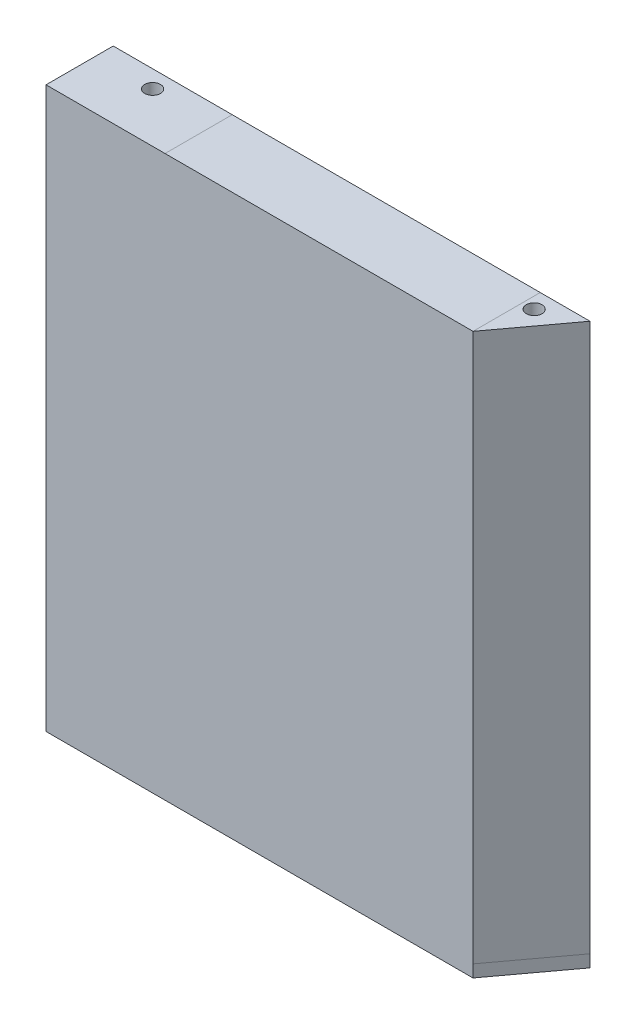
ISO-10303-21;
HEADER;
FILE_DESCRIPTION(('STEP AP214'),'2;1');
FILE_NAME('part.step','',(''),(''),'','','');
FILE_SCHEMA(('AUTOMOTIVE_DESIGN { 1 0 10303 214 1 1 1 1 }'));
ENDSEC;
DATA;
#1=APPLICATION_CONTEXT('core data for automotive mechanical design processes');
#2=APPLICATION_PROTOCOL_DEFINITION('international standard','automotive_design',2000,#1);
#3=PRODUCT_CONTEXT('',#1,'mechanical');
#4=PRODUCT('Part','Part','',(#3));
#5=PRODUCT_RELATED_PRODUCT_CATEGORY('part','',(#4));
#6=PRODUCT_DEFINITION_FORMATION('','',#4);
#7=PRODUCT_DEFINITION_CONTEXT('part definition',#1,'design');
#8=PRODUCT_DEFINITION('design','',#6,#7);
#9=PRODUCT_DEFINITION_SHAPE('','',#8);
#10=(LENGTH_UNIT() NAMED_UNIT(*) SI_UNIT(.MILLI.,.METRE.));
#11=(NAMED_UNIT(*) PLANE_ANGLE_UNIT() SI_UNIT($,.RADIAN.));
#12=(NAMED_UNIT(*) SI_UNIT($,.STERADIAN.) SOLID_ANGLE_UNIT());
#13=UNCERTAINTY_MEASURE_WITH_UNIT(LENGTH_MEASURE(1.E-05),#10,'distance_accuracy_value','');
#14=(GEOMETRIC_REPRESENTATION_CONTEXT(3) GLOBAL_UNCERTAINTY_ASSIGNED_CONTEXT((#13)) GLOBAL_UNIT_ASSIGNED_CONTEXT((#10,
#11,#12)) REPRESENTATION_CONTEXT('',''));
#15=CARTESIAN_POINT('',(0.,0.,0.));
#16=DIRECTION('',(0.,0.,1.));
#17=DIRECTION('',(1.,0.,0.));
#18=AXIS2_PLACEMENT_3D('',#15,#16,#17);
#19=CARTESIAN_POINT('',(50.3065542401003,154.635951867559,125.000000000008));
#20=DIRECTION('',(0.,0.,-1.));
#21=DIRECTION('',(-1.,0.,0.));
#22=AXIS2_PLACEMENT_3D('',#19,#20,#21);
#23=PLANE('',#22);
#24=DIRECTION('',(-0.999999999275046,-3.80776607437729E-05,0.));
#25=VECTOR('',#24,1.);
#26=CARTESIAN_POINT('',(50.3062876964751,161.635951862484,125.000000000008));
#27=LINE('',#26,#25);
#28=CARTESIAN_POINT('',(78.7062876758864,161.637033268049,125.000000000008));
#29=VERTEX_POINT('',#28);
#30=CARTESIAN_POINT('',(50.3062876964751,161.635951862484,125.000000000008));
#31=VERTEX_POINT('',#30);
#32=EDGE_CURVE('E104',#29,#31,#27,.T.);
#33=ORIENTED_EDGE('',*,*,#32,.F.);
#34=DIRECTION('',(-3.80776607443227E-05,0.999999999275046,0.));
#35=VECTOR('',#34,1.);
#36=CARTESIAN_POINT('',(78.7065542195116,154.637033273124,125.000000000008));
#37=LINE('',#36,#35);
#38=CARTESIAN_POINT('',(78.7182059836992,-151.36296650504,125.000000000008));
#39=VERTEX_POINT('',#38);
#40=EDGE_CURVE('E12',#39,#29,#37,.T.);
#41=ORIENTED_EDGE('',*,*,#40,.F.);
#42=DIRECTION('',(0.999999999275046,3.80776607459916E-05,0.));
#43=VECTOR('',#42,1.);
#44=CARTESIAN_POINT('',(73.5411158169178,-151.363163636523,125.000000000008));
#45=LINE('',#44,#43);
#46=CARTESIAN_POINT('',(73.5411158169178,-151.363163636523,125.000000000008));
#47=VERTEX_POINT('',#46);
#48=EDGE_CURVE('E125',#47,#39,#45,.T.);
#49=ORIENTED_EDGE('',*,*,#48,.F.);
#50=DIRECTION('',(-3.80776607437729E-05,0.999999999275046,0.));
#51=VECTOR('',#50,1.);
#52=CARTESIAN_POINT('',(73.5411158169178,-151.363163636523,125.000000000008));
#53=LINE('',#52,#51);
#54=CARTESIAN_POINT('',(73.5294640527302,154.636836141641,125.000000000008));
#55=VERTEX_POINT('',#54);
#56=EDGE_CURVE('E116',#47,#55,#53,.T.);
#57=ORIENTED_EDGE('',*,*,#56,.T.);
#58=DIRECTION('',(-0.999999999275046,-3.80776607437729E-05,0.));
#59=VECTOR('',#58,1.);
#60=CARTESIAN_POINT('',(50.3065542401003,154.635951867559,125.000000000008));
#61=LINE('',#60,#59);
#62=CARTESIAN_POINT('',(50.3065542401003,154.635951867559,125.000000000008));
#63=VERTEX_POINT('',#62);
#64=EDGE_CURVE('E71',#55,#63,#61,.T.);
#65=ORIENTED_EDGE('',*,*,#64,.T.);
#66=DIRECTION('',(-3.80776607443227E-05,0.999999999275046,0.));
#67=VECTOR('',#66,1.);
#68=CARTESIAN_POINT('',(50.3065542401003,154.635951867559,125.000000000008));
#69=LINE('',#68,#67);
#70=EDGE_CURVE('E97',#63,#31,#69,.T.);
#71=ORIENTED_EDGE('',*,*,#70,.T.);
#72=EDGE_LOOP('',(#33,#41,#49,#57,#65,#71));
#73=FACE_BOUND('',#72,.T.);
#74=ADVANCED_FACE('F47',(#73),#23,.T.);
#75=CARTESIAN_POINT('',(78.7065542195116,154.637033273124,125.000000000008));
#76=DIRECTION('',(0.804002053393767,3.06145174490608E-05,0.594626519086862));
#77=DIRECTION('',(0.594626519365518,0.,-0.804002053770542));
#78=AXIS2_PLACEMENT_3D('',#75,#76,#77);
#79=PLANE('',#78);
#80=DIRECTION('',(0.594626518655785,2.26419868630401E-05,-0.804002053976631));
#81=VECTOR('',#80,1.);
#82=CARTESIAN_POINT('',(78.7062876758864,161.637033268049,125.000000000008));
#83=LINE('',#82,#81);
#84=CARTESIAN_POINT('',(50.3062876964751,161.635951862484,163.400000000009));
#85=VERTEX_POINT('',#84);
#86=EDGE_CURVE('E102',#85,#29,#83,.T.);
#87=ORIENTED_EDGE('',*,*,#86,.F.);
#88=DIRECTION('',(-3.80776607443227E-05,0.999999999275046,0.));
#89=VECTOR('',#88,1.);
#90=CARTESIAN_POINT('',(50.3065542401003,154.635951867559,163.400000000009));
#91=LINE('',#90,#89);
#92=CARTESIAN_POINT('',(50.3182060042879,-151.364047910605,163.400000000009));
#93=VERTEX_POINT('',#92);
#94=EDGE_CURVE('E55',#93,#85,#91,.T.);
#95=ORIENTED_EDGE('',*,*,#94,.F.);
#96=DIRECTION('',(-0.594626518655785,-2.26419868630401E-05,0.804002053976631));
#97=VECTOR('',#96,1.);
#98=CARTESIAN_POINT('',(50.3182060042879,-151.364047910605,163.400000000009));
#99=LINE('',#98,#97);
#100=EDGE_CURVE('E119',#39,#93,#99,.T.);
#101=ORIENTED_EDGE('',*,*,#100,.F.);
#102=ORIENTED_EDGE('',*,*,#40,.T.);
#103=EDGE_LOOP('',(#87,#95,#101,#102));
#104=FACE_BOUND('',#103,.T.);
#105=ADVANCED_FACE('F106',(#104),#79,.T.);
#106=CARTESIAN_POINT('',(50.3065542401003,154.635951867559,125.000000000008));
#107=DIRECTION('',(-0.999999999275046,-3.80776607443227E-05,0.));
#108=DIRECTION('',(3.80776607443227E-05,-0.999999999275046,0.));
#109=AXIS2_PLACEMENT_3D('',#106,#107,#108);
#110=PLANE('',#109);
#111=DIRECTION('',(0.,0.,1.));
#112=VECTOR('',#111,1.);
#113=CARTESIAN_POINT('',(50.3062876964751,161.635951862484,125.000000000008));
#114=LINE('',#113,#112);
#115=EDGE_CURVE('E88',#31,#85,#114,.T.);
#116=ORIENTED_EDGE('',*,*,#115,.F.);
#117=ORIENTED_EDGE('',*,*,#70,.F.);
#118=DIRECTION('',(0.,0.,1.));
#119=VECTOR('',#118,1.);
#120=CARTESIAN_POINT('',(50.3065542401003,154.635951867559,125.000000000008));
#121=LINE('',#120,#119);
#122=CARTESIAN_POINT('',(50.3065542401003,154.635951867559,156.399990755343));
#123=VERTEX_POINT('',#122);
#124=EDGE_CURVE('E109',#63,#123,#121,.T.);
#125=ORIENTED_EDGE('',*,*,#124,.T.);
#126=DIRECTION('',(-3.80776607437729E-05,0.999999999275046,0.));
#127=VECTOR('',#126,1.);
#128=CARTESIAN_POINT('',(50.3182060042879,-151.364047910605,156.399990755343));
#129=LINE('',#128,#127);
#130=CARTESIAN_POINT('',(50.3182060042879,-151.364047910605,156.399990755343));
#131=VERTEX_POINT('',#130);
#132=EDGE_CURVE('E115',#131,#123,#129,.T.);
#133=ORIENTED_EDGE('',*,*,#132,.F.);
#134=DIRECTION('',(0.,0.,-1.));
#135=VECTOR('',#134,1.);
#136=CARTESIAN_POINT('',(50.3182060042879,-151.364047910605,156.399990755343));
#137=LINE('',#136,#135);
#138=EDGE_CURVE('E92',#93,#131,#137,.T.);
#139=ORIENTED_EDGE('',*,*,#138,.F.);
#140=ORIENTED_EDGE('',*,*,#94,.T.);
#141=EDGE_LOOP('',(#116,#117,#125,#133,#139,#140));
#142=FACE_BOUND('',#141,.T.);
#143=ADVANCED_FACE('F87',(#142),#110,.T.);
#144=CARTESIAN_POINT('',(-0.00588810236984288,154.634036087447,0.));
#145=DIRECTION('',(3.80776607437729E-05,-0.999999999275046,0.));
#146=DIRECTION('',(0.999999999275046,3.80776607437729E-05,0.));
#147=AXIS2_PLACEMENT_3D('',#144,#145,#146);
#148=PLANE('',#147);
#149=CARTESIAN_POINT('',(56.8175434212163,154.636199790796,135.000000000008));
#150=DIRECTION('',(3.80776607437729E-05,-0.999999999275046,0.));
#151=DIRECTION('',(0.999999999275046,3.80776607437729E-05,0.));
#152=AXIS2_PLACEMENT_3D('',#149,#150,#151);
#153=CIRCLE('',#152,4.50000000000001);
#154=CARTESIAN_POINT('',(61.317543417954,154.636371140269,135.000000000008));
#155=VERTEX_POINT('',#154);
#156=EDGE_CURVE('E123',#155,#155,#153,.T.);
#157=ORIENTED_EDGE('',*,*,#156,.F.);
#158=EDGE_LOOP('',(#157));
#159=FACE_BOUND('',#158,.T.);
#160=DIRECTION('',(0.594626518655785,2.2641986862746E-05,-0.804002053976631));
#161=VECTOR('',#160,1.);
#162=CARTESIAN_POINT('',(50.3065542401003,154.635951867559,156.399990755343));
#163=LINE('',#162,#161);
#164=EDGE_CURVE('E63',#123,#55,#163,.T.);
#165=ORIENTED_EDGE('',*,*,#164,.F.);
#166=ORIENTED_EDGE('',*,*,#124,.F.);
#167=ORIENTED_EDGE('',*,*,#64,.F.);
#168=EDGE_LOOP('',(#165,#166,#167));
#169=FACE_BOUND('',#168,.T.);
#170=ADVANCED_FACE('F162',(#159,#169),#148,.T.);
#171=CARTESIAN_POINT('',(-0.00615464599505314,161.634036082372,0.));
#172=DIRECTION('',(3.80776607437729E-05,-0.999999999275046,0.));
#173=DIRECTION('',(0.999999999275046,3.80776607437729E-05,0.));
#174=AXIS2_PLACEMENT_3D('',#171,#172,#173);
#175=PLANE('',#174);
#176=CARTESIAN_POINT('',(56.8172768775909,161.636199785721,135.000000000008));
#177=DIRECTION('',(3.80776607437729E-05,-0.999999999275046,0.));
#178=DIRECTION('',(0.999999999275046,3.80776607437729E-05,0.));
#179=AXIS2_PLACEMENT_3D('',#176,#177,#178);
#180=CIRCLE('',#179,4.50000000000001);
#181=CARTESIAN_POINT('',(61.3172768743286,161.636371135195,135.000000000008));
#182=VERTEX_POINT('',#181);
#183=EDGE_CURVE('E50',#182,#182,#180,.T.);
#184=ORIENTED_EDGE('',*,*,#183,.T.);
#185=EDGE_LOOP('',(#184));
#186=FACE_BOUND('',#185,.T.);
#187=ORIENTED_EDGE('',*,*,#32,.T.);
#188=ORIENTED_EDGE('',*,*,#115,.T.);
#189=ORIENTED_EDGE('',*,*,#86,.T.);
#190=EDGE_LOOP('',(#187,#188,#189));
#191=FACE_BOUND('',#190,.T.);
#192=ADVANCED_FACE('F101',(#186,#191),#175,.F.);
#193=CARTESIAN_POINT('',(50.3182060042879,-151.364047910605,156.399990755343));
#194=DIRECTION('',(0.804002053393766,3.06145174486187E-05,0.594626519086862));
#195=DIRECTION('',(0.594626519365519,0.,-0.804002053770541));
#196=AXIS2_PLACEMENT_3D('',#193,#194,#195);
#197=PLANE('',#196);
#198=ORIENTED_EDGE('',*,*,#164,.T.);
#199=ORIENTED_EDGE('',*,*,#56,.F.);
#200=DIRECTION('',(0.594626518655785,2.2641986862746E-05,-0.804002053976631));
#201=VECTOR('',#200,1.);
#202=CARTESIAN_POINT('',(50.3182060042879,-151.364047910605,156.399990755343));
#203=LINE('',#202,#201);
#204=EDGE_CURVE('E128',#131,#47,#203,.T.);
#205=ORIENTED_EDGE('',*,*,#204,.F.);
#206=ORIENTED_EDGE('',*,*,#132,.T.);
#207=EDGE_LOOP('',(#198,#199,#205,#206));
#208=FACE_BOUND('',#207,.T.);
#209=ADVANCED_FACE('F146',(#208),#197,.F.);
#210=CARTESIAN_POINT('',(0.0057636618174047,-151.365963690718,0.));
#211=DIRECTION('',(-3.80776607459916E-05,0.999999999275046,0.));
#212=DIRECTION('',(-0.999999999275046,-3.80776607459916E-05,0.));
#213=AXIS2_PLACEMENT_3D('',#210,#211,#212);
#214=PLANE('',#213);
#215=ORIENTED_EDGE('',*,*,#138,.T.);
#216=ORIENTED_EDGE('',*,*,#204,.T.);
#217=ORIENTED_EDGE('',*,*,#48,.T.);
#218=ORIENTED_EDGE('',*,*,#100,.T.);
#219=EDGE_LOOP('',(#215,#216,#217,#218));
#220=FACE_BOUND('',#219,.T.);
#221=ADVANCED_FACE('F141',(#220),#214,.F.);
#222=CARTESIAN_POINT('',(56.8172764826691,161.646571268237,135.000000000008));
#223=DIRECTION('',(3.80776607748151E-05,-0.999999999275046,0.));
#224=DIRECTION('',(0.999999999275046,3.80776607748151E-05,0.));
#225=AXIS2_PLACEMENT_3D('',#222,#223,#224);
#226=CYLINDRICAL_SURFACE('',#225,4.50000000000001);
#227=ORIENTED_EDGE('',*,*,#156,.T.);
#228=EDGE_LOOP('',(#227));
#229=FACE_BOUND('',#228,.T.);
#230=ORIENTED_EDGE('',*,*,#183,.F.);
#231=EDGE_LOOP('',(#230));
#232=FACE_BOUND('',#231,.T.);
#233=ADVANCED_FACE('F139',(#229,#232),#226,.F.);
#234=CLOSED_SHELL('',(#74,#105,#143,#170,#192,#209,#221,#233));
#235=MANIFOLD_SOLID_BREP('B2',#234);
#236=CARTESIAN_POINT('',(50.2840677250155,147.63595100625,163.400000000009));
#237=DIRECTION('',(-1.,0.,0.));
#238=DIRECTION('',(0.,-1.,0.));
#239=AXIS2_PLACEMENT_3D('',#236,#237,#238);
#240=PLANE('',#239);
#241=DIRECTION('',(0.,1.,0.));
#242=VECTOR('',#241,1.);
#243=CARTESIAN_POINT('',(50.2840677250155,147.63595100625,163.400000000009));
#244=LINE('',#243,#242);
#245=CARTESIAN_POINT('',(50.2840677250154,-158.364049215907,163.400000000009));
#246=VERTEX_POINT('',#245);
#247=CARTESIAN_POINT('',(50.2840677250155,147.63595100625,163.400000000009));
#248=VERTEX_POINT('',#247);
#249=EDGE_CURVE('E243',#246,#248,#244,.T.);
#250=ORIENTED_EDGE('',*,*,#249,.F.);
#251=DIRECTION('',(0.,0.999999998674633,-5.14852877398055E-05));
#252=VECTOR('',#251,1.);
#253=CARTESIAN_POINT('',(50.2840677250155,147.635950195125,163.38424550197));
#254=LINE('',#253,#252);
#255=CARTESIAN_POINT('',(50.2840677250155,-151.364049210832,163.399639602994));
#256=VERTEX_POINT('',#255);
#257=EDGE_CURVE('E423',#246,#256,#254,.T.);
#258=ORIENTED_EDGE('',*,*,#257,.T.);
#259=DIRECTION('',(0.,0.,1.));
#260=VECTOR('',#259,1.);
#261=CARTESIAN_POINT('',(50.2840677250155,-151.364049210832,163.400000000009));
#262=LINE('',#261,#260);
#263=CARTESIAN_POINT('',(50.2840677250235,-151.364049210832,156.400000000009));
#264=VERTEX_POINT('',#263);
#265=EDGE_CURVE('E334',#264,#256,#262,.T.);
#266=ORIENTED_EDGE('',*,*,#265,.F.);
#267=DIRECTION('',(0.,1.,0.));
#268=VECTOR('',#267,1.);
#269=CARTESIAN_POINT('',(50.2840677250155,147.63595100625,156.400000000009));
#270=LINE('',#269,#268);
#271=CARTESIAN_POINT('',(50.2840677250155,147.63595100625,156.400000000009));
#272=VERTEX_POINT('',#271);
#273=EDGE_CURVE('E293',#264,#272,#270,.T.);
#274=ORIENTED_EDGE('',*,*,#273,.T.);
#275=DIRECTION('',(0.,0.,-1.));
#276=VECTOR('',#275,1.);
#277=CARTESIAN_POINT('',(50.2840677250155,147.63595100625,163.400000000009));
#278=LINE('',#277,#276);
#279=EDGE_CURVE('E45',#248,#272,#278,.T.);
#280=ORIENTED_EDGE('',*,*,#279,.F.);
#281=EDGE_LOOP('',(#250,#258,#266,#274,#280));
#282=FACE_BOUND('',#281,.T.);
#283=ADVANCED_FACE('F227',(#282),#240,.F.);
#284=CARTESIAN_POINT('',(50.2840677250155,147.63595100625,163.400000000009));
#285=DIRECTION('',(-0.999998740494545,0.0015871387224644,0.));
#286=DIRECTION('',(-0.0015871387224644,-0.999998740494545,0.));
#287=AXIS2_PLACEMENT_3D('',#284,#285,#286);
#288=PLANE('',#287);
#289=DIRECTION('',(0.0015871387224644,0.999998740494545,0.));
#290=VECTOR('',#289,1.);
#291=CARTESIAN_POINT('',(50.2840677250155,147.63595100625,156.400000000009));
#292=LINE('',#291,#290);
#293=CARTESIAN_POINT('',(50.2951777107453,154.635951434367,156.400000000009));
#294=VERTEX_POINT('',#293);
#295=EDGE_CURVE('E277',#272,#294,#292,.T.);
#296=ORIENTED_EDGE('',*,*,#295,.T.);
#297=DIRECTION('',(0.,0.,1.));
#298=VECTOR('',#297,1.);
#299=CARTESIAN_POINT('',(50.2951777107453,154.635951434367,125.000000000008));
#300=LINE('',#299,#298);
#301=CARTESIAN_POINT('',(50.2951777107453,154.635951434367,125.000000000008));
#302=VERTEX_POINT('',#301);
#303=EDGE_CURVE('E290',#302,#294,#300,.T.);
#304=ORIENTED_EDGE('',*,*,#303,.F.);
#305=DIRECTION('',(0.00158713872246539,0.999998740494545,0.));
#306=VECTOR('',#305,1.);
#307=CARTESIAN_POINT('',(50.2951777107453,154.635951434367,125.000000000008));
#308=LINE('',#307,#306);
#309=CARTESIAN_POINT('',(50.3062876964751,161.635951862484,125.000000000008));
#310=VERTEX_POINT('',#309);
#311=EDGE_CURVE('E432',#302,#310,#308,.T.);
#312=ORIENTED_EDGE('',*,*,#311,.T.);
#313=DIRECTION('',(0.,0.,1.));
#314=VECTOR('',#313,1.);
#315=CARTESIAN_POINT('',(50.3062876964751,161.635951862484,125.000000000008));
#316=LINE('',#315,#314);
#317=CARTESIAN_POINT('',(50.3062876964751,161.635951862484,163.400000000009));
#318=VERTEX_POINT('',#317);
#319=EDGE_CURVE('E299',#310,#318,#316,.T.);
#320=ORIENTED_EDGE('',*,*,#319,.T.);
#321=DIRECTION('',(0.0015871387224644,0.999998740494545,0.));
#322=VECTOR('',#321,1.);
#323=CARTESIAN_POINT('',(50.2840677250155,147.63595100625,163.400000000009));
#324=LINE('',#323,#322);
#325=EDGE_CURVE('E236',#248,#318,#324,.T.);
#326=ORIENTED_EDGE('',*,*,#325,.F.);
#327=ORIENTED_EDGE('',*,*,#279,.T.);
#328=EDGE_LOOP('',(#296,#304,#312,#320,#326,#327));
#329=FACE_BOUND('',#328,.T.);
#330=ADVANCED_FACE('F287',(#329),#288,.F.);
#331=CARTESIAN_POINT('',(0.,0.,163.400000000009));
#332=DIRECTION('',(0.,0.,1.));
#333=DIRECTION('',(1.,0.,0.));
#334=AXIS2_PLACEMENT_3D('',#331,#332,#333);
#335=PLANE('',#334);
#336=ORIENTED_EDGE('',*,*,#325,.T.);
#337=DIRECTION('',(-0.999999999275046,-3.80776607443227E-05,0.));
#338=VECTOR('',#337,1.);
#339=CARTESIAN_POINT('',(50.3062876964751,161.635951862484,163.400000000009));
#340=LINE('',#339,#338);
#341=CARTESIAN_POINT('',(-125.672841840363,161.629250988886,163.400000000009));
#342=VERTEX_POINT('',#341);
#343=EDGE_CURVE('E426',#318,#342,#340,.T.);
#344=ORIENTED_EDGE('',*,*,#343,.T.);
#345=DIRECTION('',(-1.,0.,0.));
#346=VECTOR('',#345,1.);
#347=CARTESIAN_POINT('',(-125.672841840363,161.629250988886,163.400000000009));
#348=LINE('',#347,#346);
#349=CARTESIAN_POINT('',(-193.670804646049,161.629250988886,163.400000000009));
#350=VERTEX_POINT('',#349);
#351=EDGE_CURVE('E473',#342,#350,#348,.T.);
#352=ORIENTED_EDGE('',*,*,#351,.T.);
#353=DIRECTION('',(0.,-1.,0.));
#354=VECTOR('',#353,1.);
#355=CARTESIAN_POINT('',(-193.670804646049,161.629250988886,163.400000000009));
#356=LINE('',#355,#354);
#357=CARTESIAN_POINT('',(-193.670804646049,104.626907443491,163.400000000009));
#358=VERTEX_POINT('',#357);
#359=EDGE_CURVE('E477',#350,#358,#356,.T.);
#360=ORIENTED_EDGE('',*,*,#359,.T.);
#361=DIRECTION('',(3.80776607549472E-05,-0.999999999275046,0.));
#362=VECTOR('',#361,1.);
#363=CARTESIAN_POINT('',(-193.670804646049,104.626907443491,163.400000000009));
#364=LINE('',#363,#362);
#365=CARTESIAN_POINT('',(-193.670538102423,97.6269074369599,163.400000000009));
#366=VERTEX_POINT('',#365);
#367=EDGE_CURVE('E483',#358,#366,#364,.T.);
#368=ORIENTED_EDGE('',*,*,#367,.T.);
#369=DIRECTION('',(0.,-1.,0.));
#370=VECTOR('',#369,1.);
#371=CARTESIAN_POINT('',(-193.670538102423,97.6269074369599,163.400000000009));
#372=LINE('',#371,#370);
#373=CARTESIAN_POINT('',(-193.670538102423,-158.372995371589,163.400000000009));
#374=VERTEX_POINT('',#373);
#375=EDGE_CURVE('E434',#366,#374,#372,.T.);
#376=ORIENTED_EDGE('',*,*,#375,.T.);
#377=DIRECTION('',(1.,2.74178898694674E-13,0.));
#378=VECTOR('',#377,1.);
#379=CARTESIAN_POINT('',(-193.670538102423,-158.372995371589,163.400000000009));
#380=LINE('',#379,#378);
#381=CARTESIAN_POINT('',(-184.660923425468,-158.372995371587,163.400000000009));
#382=VERTEX_POINT('',#381);
#383=EDGE_CURVE('E430',#374,#382,#380,.T.);
#384=ORIENTED_EDGE('',*,*,#383,.T.);
#385=DIRECTION('',(0.999999999275046,3.80776607748174E-05,0.));
#386=VECTOR('',#385,1.);
#387=CARTESIAN_POINT('',(-184.660923425468,-158.372995371587,163.400000000009));
#388=LINE('',#387,#386);
#389=EDGE_CURVE('E411',#382,#246,#388,.T.);
#390=ORIENTED_EDGE('',*,*,#389,.T.);
#391=ORIENTED_EDGE('',*,*,#249,.T.);
#392=EDGE_LOOP('',(#336,#344,#352,#360,#368,#376,#384,#390,#391));
#393=FACE_BOUND('',#392,.T.);
#394=ADVANCED_FACE('F428',(#393),#335,.T.);
#395=CARTESIAN_POINT('',(0.,0.,156.400000000009));
#396=DIRECTION('',(0.,0.,1.));
#397=DIRECTION('',(1.,0.,0.));
#398=AXIS2_PLACEMENT_3D('',#395,#396,#397);
#399=PLANE('',#398);
#400=DIRECTION('',(-1.,0.,0.));
#401=VECTOR('',#400,1.);
#402=CARTESIAN_POINT('',(-125.672708569028,154.629250988886,156.400000000009));
#403=LINE('',#402,#401);
#404=CARTESIAN_POINT('',(-125.672708569028,154.629250988886,156.400000000009));
#405=VERTEX_POINT('',#404);
#406=CARTESIAN_POINT('',(-186.670804646049,154.629250988889,156.400000000009));
#407=VERTEX_POINT('',#406);
#408=EDGE_CURVE('E279',#405,#407,#403,.T.);
#409=ORIENTED_EDGE('',*,*,#408,.F.);
#410=DIRECTION('',(-0.999999999275046,-3.80776607554781E-05,0.));
#411=VECTOR('',#410,1.);
#412=CARTESIAN_POINT('',(-125.672708569028,154.629250988886,156.400000000009));
#413=LINE('',#412,#411);
#414=EDGE_CURVE('E273',#294,#405,#413,.T.);
#415=ORIENTED_EDGE('',*,*,#414,.F.);
#416=ORIENTED_EDGE('',*,*,#295,.F.);
#417=ORIENTED_EDGE('',*,*,#273,.F.);
#418=DIRECTION('',(0.999999999275046,3.80776607746463E-05,0.));
#419=VECTOR('',#418,1.);
#420=CARTESIAN_POINT('',(50.2840677250155,-151.364049210832,156.400000000009));
#421=LINE('',#420,#419);
#422=CARTESIAN_POINT('',(-184.661056762062,-151.372995371589,156.400000000009));
#423=VERTEX_POINT('',#422);
#424=EDGE_CURVE('E326',#423,#264,#421,.T.);
#425=ORIENTED_EDGE('',*,*,#424,.F.);
#426=DIRECTION('',(1.,-1.22929543070416E-12,0.));
#427=VECTOR('',#426,1.);
#428=CARTESIAN_POINT('',(-184.661056762062,-151.372995371589,156.400000000009));
#429=LINE('',#428,#427);
#430=CARTESIAN_POINT('',(-186.670538102423,-151.372995371587,156.400000000009));
#431=VERTEX_POINT('',#430);
#432=EDGE_CURVE('E323',#431,#423,#429,.T.);
#433=ORIENTED_EDGE('',*,*,#432,.F.);
#434=DIRECTION('',(0.,-1.,0.));
#435=VECTOR('',#434,1.);
#436=CARTESIAN_POINT('',(-186.670538102423,97.6270407081138,156.400000000009));
#437=LINE('',#436,#435);
#438=CARTESIAN_POINT('',(-186.670538102423,97.6270407081138,156.400000000009));
#439=VERTEX_POINT('',#438);
#440=EDGE_CURVE('E320',#439,#431,#437,.T.);
#441=ORIENTED_EDGE('',*,*,#440,.F.);
#442=DIRECTION('',(3.807766075395E-05,-0.999999999275046,0.));
#443=VECTOR('',#442,1.);
#444=CARTESIAN_POINT('',(-186.670804646049,104.627040714099,156.400000000009));
#445=LINE('',#444,#443);
#446=CARTESIAN_POINT('',(-186.670804646049,104.627040714099,156.400000000009));
#447=VERTEX_POINT('',#446);
#448=EDGE_CURVE('E317',#447,#439,#445,.T.);
#449=ORIENTED_EDGE('',*,*,#448,.F.);
#450=DIRECTION('',(0.,-1.,0.));
#451=VECTOR('',#450,1.);
#452=CARTESIAN_POINT('',(-186.670804646049,154.629250988889,156.400000000009));
#453=LINE('',#452,#451);
#454=EDGE_CURVE('E313',#407,#447,#453,.T.);
#455=ORIENTED_EDGE('',*,*,#454,.F.);
#456=EDGE_LOOP('',(#409,#415,#416,#417,#425,#433,#441,#449,#455));
#457=FACE_BOUND('',#456,.T.);
#458=ADVANCED_FACE('F275',(#457),#399,.F.);
#459=CARTESIAN_POINT('',(50.2951777107453,154.635951434367,125.000000000008));
#460=DIRECTION('',(3.80776607443095E-05,-0.999999999275046,0.));
#461=DIRECTION('',(0.999999999275046,3.80776607443095E-05,0.));
#462=AXIS2_PLACEMENT_3D('',#459,#460,#461);
#463=PLANE('',#462);
#464=ORIENTED_EDGE('',*,*,#414,.T.);
#465=DIRECTION('',(0.,0.,1.));
#466=VECTOR('',#465,1.);
#467=CARTESIAN_POINT('',(-125.672708569028,154.629250988886,125.000000000008));
#468=LINE('',#467,#466);
#469=CARTESIAN_POINT('',(-125.672708569028,154.629250988886,125.000000000008));
#470=VERTEX_POINT('',#469);
#471=EDGE_CURVE('E314',#470,#405,#468,.T.);
#472=ORIENTED_EDGE('',*,*,#471,.F.);
#473=DIRECTION('',(0.999999999275046,3.80776607443095E-05,0.));
#474=VECTOR('',#473,1.);
#475=CARTESIAN_POINT('',(50.2951777107453,154.635951434367,125.000000000008));
#476=LINE('',#475,#474);
#477=EDGE_CURVE('E298',#470,#302,#476,.T.);
#478=ORIENTED_EDGE('',*,*,#477,.T.);
#479=ORIENTED_EDGE('',*,*,#303,.T.);
#480=EDGE_LOOP('',(#464,#472,#478,#479));
#481=FACE_BOUND('',#480,.T.);
#482=ADVANCED_FACE('F296',(#481),#463,.T.);
#483=CARTESIAN_POINT('',(-125.672708569028,154.629250988886,125.000000000008));
#484=DIRECTION('',(0.,-1.,0.));
#485=DIRECTION('',(1.,0.,0.));
#486=AXIS2_PLACEMENT_3D('',#483,#484,#485);
#487=PLANE('',#486);
#488=CARTESIAN_POINT('',(-161.18245647223,154.629250988888,135.000000000008));
#489=DIRECTION('',(0.,-1.,0.));
#490=DIRECTION('',(1.,0.,0.));
#491=AXIS2_PLACEMENT_3D('',#488,#489,#490);
#492=ELLIPSE('',#491,4.50000000326231,4.50000000000001);
#493=CARTESIAN_POINT('',(-156.682456468967,154.629250988888,135.000000000008));
#494=VERTEX_POINT('',#493);
#495=EDGE_CURVE('E605',#494,#494,#492,.T.);
#496=ORIENTED_EDGE('',*,*,#495,.F.);
#497=EDGE_LOOP('',(#496));
#498=FACE_BOUND('',#497,.T.);
#499=ORIENTED_EDGE('',*,*,#408,.T.);
#500=DIRECTION('',(0.,0.,1.));
#501=VECTOR('',#500,1.);
#502=CARTESIAN_POINT('',(-186.670804646049,154.629250988889,125.000000000008));
#503=LINE('',#502,#501);
#504=CARTESIAN_POINT('',(-186.670804646049,154.629250988889,125.000000000008));
#505=VERTEX_POINT('',#504);
#506=EDGE_CURVE('E439',#505,#407,#503,.T.);
#507=ORIENTED_EDGE('',*,*,#506,.F.);
#508=DIRECTION('',(1.,0.,0.));
#509=VECTOR('',#508,1.);
#510=CARTESIAN_POINT('',(-125.672708569028,154.629250988886,125.000000000008));
#511=LINE('',#510,#509);
#512=EDGE_CURVE('E300',#505,#470,#511,.T.);
#513=ORIENTED_EDGE('',*,*,#512,.T.);
#514=ORIENTED_EDGE('',*,*,#471,.T.);
#515=EDGE_LOOP('',(#499,#507,#513,#514));
#516=FACE_BOUND('',#515,.T.);
#517=ADVANCED_FACE('F519',(#498,#516),#487,.T.);
#518=CARTESIAN_POINT('',(-186.670804646049,154.629250988889,125.000000000008));
#519=DIRECTION('',(1.,0.,0.));
#520=DIRECTION('',(0.,1.,0.));
#521=AXIS2_PLACEMENT_3D('',#518,#519,#520);
#522=PLANE('',#521);
#523=ORIENTED_EDGE('',*,*,#454,.T.);
#524=DIRECTION('',(0.,0.,1.));
#525=VECTOR('',#524,1.);
#526=CARTESIAN_POINT('',(-186.670804646049,104.627040714099,125.000000000008));
#527=LINE('',#526,#525);
#528=CARTESIAN_POINT('',(-186.670804646049,104.627040714099,125.000000000008));
#529=VERTEX_POINT('',#528);
#530=EDGE_CURVE('E442',#529,#447,#527,.T.);
#531=ORIENTED_EDGE('',*,*,#530,.F.);
#532=DIRECTION('',(0.,1.,0.));
#533=VECTOR('',#532,1.);
#534=CARTESIAN_POINT('',(-186.670804646049,154.629250988889,125.000000000008));
#535=LINE('',#534,#533);
#536=EDGE_CURVE('E306',#529,#505,#535,.T.);
#537=ORIENTED_EDGE('',*,*,#536,.T.);
#538=ORIENTED_EDGE('',*,*,#506,.T.);
#539=EDGE_LOOP('',(#523,#531,#537,#538));
#540=FACE_BOUND('',#539,.T.);
#541=ADVANCED_FACE('F565',(#540),#522,.T.);
#542=CARTESIAN_POINT('',(-186.670804646049,104.627040714099,125.000000000008));
#543=DIRECTION('',(0.999999999275046,3.807766075395E-05,0.));
#544=DIRECTION('',(-3.807766075395E-05,0.999999999275046,0.));
#545=AXIS2_PLACEMENT_3D('',#542,#543,#544);
#546=PLANE('',#545);
#547=ORIENTED_EDGE('',*,*,#448,.T.);
#548=DIRECTION('',(0.,0.,1.));
#549=VECTOR('',#548,1.);
#550=CARTESIAN_POINT('',(-186.670538102423,97.6270407081138,125.000000000008));
#551=LINE('',#550,#549);
#552=CARTESIAN_POINT('',(-186.670538102423,97.6270407081138,125.000000000008));
#553=VERTEX_POINT('',#552);
#554=EDGE_CURVE('E445',#553,#439,#551,.T.);
#555=ORIENTED_EDGE('',*,*,#554,.F.);
#556=DIRECTION('',(-3.807766075395E-05,0.999999999275046,0.));
#557=VECTOR('',#556,1.);
#558=CARTESIAN_POINT('',(-186.670804646049,104.627040714099,125.000000000008));
#559=LINE('',#558,#557);
#560=EDGE_CURVE('E559',#553,#529,#559,.T.);
#561=ORIENTED_EDGE('',*,*,#560,.T.);
#562=ORIENTED_EDGE('',*,*,#530,.T.);
#563=EDGE_LOOP('',(#547,#555,#561,#562));
#564=FACE_BOUND('',#563,.T.);
#565=ADVANCED_FACE('F575',(#564),#546,.T.);
#566=CARTESIAN_POINT('',(-186.670538102423,97.6270407081138,125.000000000008));
#567=DIRECTION('',(1.,0.,0.));
#568=DIRECTION('',(0.,1.,0.));
#569=AXIS2_PLACEMENT_3D('',#566,#567,#568);
#570=PLANE('',#569);
#571=CARTESIAN_POINT('',(-186.670538102423,-114.594279246317,142.900000000005));
#572=DIRECTION('',(1.,0.,0.));
#573=DIRECTION('',(0.,1.,0.));
#574=AXIS2_PLACEMENT_3D('',#571,#572,#573);
#575=CIRCLE('',#574,7.13999999999999);
#576=CARTESIAN_POINT('',(-186.670538102423,-107.454279246317,142.900000000005));
#577=VERTEX_POINT('',#576);
#578=EDGE_CURVE('E604',#577,#577,#575,.F.);
#579=ORIENTED_EDGE('',*,*,#578,.T.);
#580=EDGE_LOOP('',(#579));
#581=FACE_BOUND('',#580,.T.);
#582=ORIENTED_EDGE('',*,*,#440,.T.);
#583=DIRECTION('',(0.,0.,1.));
#584=VECTOR('',#583,1.);
#585=CARTESIAN_POINT('',(-186.670538102423,-151.372995371587,125.000000000008));
#586=LINE('',#585,#584);
#587=CARTESIAN_POINT('',(-186.670538102423,-151.372995371587,125.000000000008));
#588=VERTEX_POINT('',#587);
#589=EDGE_CURVE('E448',#588,#431,#586,.T.);
#590=ORIENTED_EDGE('',*,*,#589,.F.);
#591=DIRECTION('',(0.,1.,0.));
#592=VECTOR('',#591,1.);
#593=CARTESIAN_POINT('',(-186.670538102423,97.6270407081138,125.000000000008));
#594=LINE('',#593,#592);
#595=EDGE_CURVE('E556',#588,#553,#594,.T.);
#596=ORIENTED_EDGE('',*,*,#595,.T.);
#597=ORIENTED_EDGE('',*,*,#554,.T.);
#598=EDGE_LOOP('',(#582,#590,#596,#597));
#599=FACE_BOUND('',#598,.T.);
#600=ADVANCED_FACE('F583',(#581,#599),#570,.T.);
#601=CARTESIAN_POINT('',(-186.670538102423,-151.372995371587,125.000000000008));
#602=DIRECTION('',(1.22929543070416E-12,1.,0.));
#603=DIRECTION('',(-1.,1.22929543070416E-12,0.));
#604=AXIS2_PLACEMENT_3D('',#601,#602,#603);
#605=PLANE('',#604);
#606=ORIENTED_EDGE('',*,*,#432,.T.);
#607=DIRECTION('',(0.,0.,1.));
#608=VECTOR('',#607,1.);
#609=CARTESIAN_POINT('',(-184.661056762062,-151.372995371589,125.000000000008));
#610=LINE('',#609,#608);
#611=CARTESIAN_POINT('',(-184.661056762062,-151.372995371589,125.000000000008));
#612=VERTEX_POINT('',#611);
#613=EDGE_CURVE('E451',#612,#423,#610,.T.);
#614=ORIENTED_EDGE('',*,*,#613,.F.);
#615=DIRECTION('',(-1.,1.22929543070416E-12,0.));
#616=VECTOR('',#615,1.);
#617=CARTESIAN_POINT('',(-186.670538102423,-151.372995371587,125.000000000008));
#618=LINE('',#617,#616);
#619=EDGE_CURVE('E553',#612,#588,#618,.T.);
#620=ORIENTED_EDGE('',*,*,#619,.T.);
#621=ORIENTED_EDGE('',*,*,#589,.T.);
#622=EDGE_LOOP('',(#606,#614,#620,#621));
#623=FACE_BOUND('',#622,.T.);
#624=ADVANCED_FACE('F587',(#623),#605,.T.);
#625=CARTESIAN_POINT('',(-184.661056762062,-151.372995371589,125.000000000008));
#626=DIRECTION('',(-3.80776607746463E-05,0.999999999275046,0.));
#627=DIRECTION('',(-0.999999999275046,-3.80776607746463E-05,0.));
#628=AXIS2_PLACEMENT_3D('',#625,#626,#627);
#629=PLANE('',#628);
#630=CARTESIAN_POINT('',(-161.170804656547,-151.372100917738,135.000000000008));
#631=DIRECTION('',(-3.80776607746463E-05,0.999999999275046,0.));
#632=DIRECTION('',(-0.999999999275046,-3.80776607746463E-05,0.));
#633=AXIS2_PLACEMENT_3D('',#630,#631,#632);
#634=CIRCLE('',#633,4.50000000000001);
#635=CARTESIAN_POINT('',(-165.670804653284,-151.372272267211,135.000000000008));
#636=VERTEX_POINT('',#635);
#637=EDGE_CURVE('E599',#636,#636,#634,.T.);
#638=ORIENTED_EDGE('',*,*,#637,.F.);
#639=EDGE_LOOP('',(#638));
#640=FACE_BOUND('',#639,.T.);
#641=CARTESIAN_POINT('',(56.8291951854134,-151.363799987689,135.000000000008));
#642=DIRECTION('',(-3.80776607746463E-05,0.999999999275046,0.));
#643=DIRECTION('',(-0.999999999275046,-3.80776607746463E-05,0.));
#644=AXIS2_PLACEMENT_3D('',#641,#642,#643);
#645=CIRCLE('',#644,4.50000000000001);
#646=CARTESIAN_POINT('',(52.3291951886757,-151.363971337162,135.000000000008));
#647=VERTEX_POINT('',#646);
#648=EDGE_CURVE('E602',#647,#647,#645,.T.);
#649=ORIENTED_EDGE('',*,*,#648,.F.);
#650=EDGE_LOOP('',(#649));
#651=FACE_BOUND('',#650,.T.);
#652=ORIENTED_EDGE('',*,*,#424,.T.);
#653=ORIENTED_EDGE('',*,*,#265,.T.);
#654=DIRECTION('',(-0.594626518655785,-2.26419868816364E-05,0.804002053976631));
#655=VECTOR('',#654,1.);
#656=CARTESIAN_POINT('',(78.6838011608013,-151.362967815415,125.000000000008));
#657=LINE('',#656,#655);
#658=CARTESIAN_POINT('',(78.6838011608013,-151.362967815415,125.000000000008));
#659=VERTEX_POINT('',#658);
#660=EDGE_CURVE('E419',#659,#256,#657,.T.);
#661=ORIENTED_EDGE('',*,*,#660,.F.);
#662=DIRECTION('',(-0.999999999275046,-3.80776607746463E-05,0.));
#663=VECTOR('',#662,1.);
#664=CARTESIAN_POINT('',(-184.661056762062,-151.372995371589,125.000000000008));
#665=LINE('',#664,#663);
#666=EDGE_CURVE('E551',#659,#612,#665,.T.);
#667=ORIENTED_EDGE('',*,*,#666,.T.);
#668=ORIENTED_EDGE('',*,*,#613,.T.);
#669=EDGE_LOOP('',(#652,#653,#661,#667,#668));
#670=FACE_BOUND('',#669,.T.);
#671=ADVANCED_FACE('F503',(#640,#651,#670),#629,.T.);
#672=CARTESIAN_POINT('',(-184.660923425468,-158.372995371587,125.000000000008));
#673=DIRECTION('',(3.80776607748174E-05,-0.999999999275046,0.));
#674=DIRECTION('',(0.999999999275046,3.80776607748174E-05,0.));
#675=AXIS2_PLACEMENT_3D('',#672,#673,#674);
#676=PLANE('',#675);
#677=CARTESIAN_POINT('',(-161.170538112921,-158.372100912663,135.000000000008));
#678=DIRECTION('',(3.80776607748151E-05,-0.999999999275046,0.));
#679=DIRECTION('',(0.999999999275046,3.80776607748151E-05,0.));
#680=AXIS2_PLACEMENT_3D('',#677,#678,#679);
#681=CIRCLE('',#680,4.50000000000001);
#682=CARTESIAN_POINT('',(-156.670538116183,-158.371929563189,135.000000000008));
#683=VERTEX_POINT('',#682);
#684=EDGE_CURVE('E654',#683,#683,#681,.T.);
#685=ORIENTED_EDGE('',*,*,#684,.F.);
#686=EDGE_LOOP('',(#685));
#687=FACE_BOUND('',#686,.T.);
#688=CARTESIAN_POINT('',(56.8294617290388,-158.363799982614,135.000000000008));
#689=DIRECTION('',(3.80776607748151E-05,-0.999999999275046,0.));
#690=DIRECTION('',(0.999999999275046,3.80776607748151E-05,0.));
#691=AXIS2_PLACEMENT_3D('',#688,#689,#690);
#692=CIRCLE('',#691,4.50000000000001);
#693=CARTESIAN_POINT('',(61.3294617257766,-158.363628633141,135.000000000008));
#694=VERTEX_POINT('',#693);
#695=EDGE_CURVE('E655',#694,#694,#692,.T.);
#696=ORIENTED_EDGE('',*,*,#695,.F.);
#697=EDGE_LOOP('',(#696));
#698=FACE_BOUND('',#697,.T.);
#699=ORIENTED_EDGE('',*,*,#389,.F.);
#700=DIRECTION('',(0.,0.,1.));
#701=VECTOR('',#700,1.);
#702=CARTESIAN_POINT('',(-184.660923425468,-158.372995371587,125.000000000008));
#703=LINE('',#702,#701);
#704=CARTESIAN_POINT('',(-184.660923425468,-158.372995371587,125.000000000008));
#705=VERTEX_POINT('',#704);
#706=EDGE_CURVE('E402',#705,#382,#703,.T.);
#707=ORIENTED_EDGE('',*,*,#706,.F.);
#708=DIRECTION('',(0.999999999275046,3.80776607748174E-05,0.));
#709=VECTOR('',#708,1.);
#710=CARTESIAN_POINT('',(-184.660923425468,-158.372995371587,125.000000000008));
#711=LINE('',#710,#709);
#712=CARTESIAN_POINT('',(78.6840677044268,-158.362967810341,125.000000000008));
#713=VERTEX_POINT('',#712);
#714=EDGE_CURVE('E415',#705,#713,#711,.T.);
#715=ORIENTED_EDGE('',*,*,#714,.T.);
#716=DIRECTION('',(-0.594626518655785,-2.26419868816364E-05,0.804002053976631));
#717=VECTOR('',#716,1.);
#718=CARTESIAN_POINT('',(78.6840677044268,-158.362967810341,125.000000000008));
#719=LINE('',#718,#717);
#720=EDGE_CURVE('E408',#713,#246,#719,.T.);
#721=ORIENTED_EDGE('',*,*,#720,.T.);
#722=EDGE_LOOP('',(#699,#707,#715,#721));
#723=FACE_BOUND('',#722,.T.);
#724=ADVANCED_FACE('F410',(#687,#698,#723),#676,.T.);
#725=CARTESIAN_POINT('',(-193.670538102423,-158.372995371589,125.000000000008));
#726=DIRECTION('',(2.74178898694674E-13,-1.,0.));
#727=DIRECTION('',(1.,2.74178898694674E-13,0.));
#728=AXIS2_PLACEMENT_3D('',#725,#726,#727);
#729=PLANE('',#728);
#730=ORIENTED_EDGE('',*,*,#383,.F.);
#731=DIRECTION('',(0.,0.,1.));
#732=VECTOR('',#731,1.);
#733=CARTESIAN_POINT('',(-193.670538102423,-158.372995371589,125.000000000008));
#734=LINE('',#733,#732);
#735=CARTESIAN_POINT('',(-193.670538102423,-158.372995371589,125.000000000008));
#736=VERTEX_POINT('',#735);
#737=EDGE_CURVE('E454',#736,#374,#734,.T.);
#738=ORIENTED_EDGE('',*,*,#737,.F.);
#739=DIRECTION('',(1.,2.74178898694674E-13,0.));
#740=VECTOR('',#739,1.);
#741=CARTESIAN_POINT('',(-193.670538102423,-158.372995371589,125.000000000008));
#742=LINE('',#741,#740);
#743=EDGE_CURVE('E548',#736,#705,#742,.T.);
#744=ORIENTED_EDGE('',*,*,#743,.T.);
#745=ORIENTED_EDGE('',*,*,#706,.T.);
#746=EDGE_LOOP('',(#730,#738,#744,#745));
#747=FACE_BOUND('',#746,.T.);
#748=ADVANCED_FACE('F493',(#747),#729,.T.);
#749=CARTESIAN_POINT('',(-193.670538102423,97.6269074369599,125.000000000008));
#750=DIRECTION('',(-1.,0.,0.));
#751=DIRECTION('',(0.,0.,1.));
#752=AXIS2_PLACEMENT_3D('',#749,#750,#751);
#753=PLANE('',#752);
#754=CARTESIAN_POINT('',(-193.670538102423,-114.594279246317,135.760000000005));
#755=CARTESIAN_POINT('',(-193.670538102423,-128.874279235965,135.760000000005));
#756=CARTESIAN_POINT('',(-193.670538102423,-128.874279235965,150.040000000005));
#757=CARTESIAN_POINT('',(-193.670538102423,-114.594279246317,150.040000000005));
#758=CARTESIAN_POINT('',(-193.670538102423,-100.31427925667,150.040000000005));
#759=CARTESIAN_POINT('',(-193.670538102423,-100.314279256669,135.760000000005));
#760=CARTESIAN_POINT('',(-193.670538102423,-114.594279246317,135.760000000005));
#761=(BOUNDED_CURVE() B_SPLINE_CURVE(3,(#754,#755,#756,#757,#758,#759,#760),.UNSPECIFIED.,.T.,
.F.) B_SPLINE_CURVE_WITH_KNOTS((4,3,4),(0.,0.5,1.),
.UNSPECIFIED.) CURVE() GEOMETRIC_REPRESENTATION_ITEM() RATIONAL_B_SPLINE_CURVE((1.,
0.333333333333333,0.333333333333333,1.,0.333333333333333,0.333333333333333,1.)) REPRESENTATION_ITEM(''));
#762=CARTESIAN_POINT('',(-193.670538102423,-114.594279246317,135.760000000005));
#763=VERTEX_POINT('',#762);
#764=EDGE_CURVE('E420',#763,#763,#761,.T.);
#765=ORIENTED_EDGE('',*,*,#764,.F.);
#766=EDGE_LOOP('',(#765));
#767=FACE_BOUND('',#766,.T.);
#768=ORIENTED_EDGE('',*,*,#375,.F.);
#769=DIRECTION('',(0.,0.,1.));
#770=VECTOR('',#769,1.);
#771=CARTESIAN_POINT('',(-193.670538102423,97.6269074369599,125.000000000008));
#772=LINE('',#771,#770);
#773=CARTESIAN_POINT('',(-193.670538102423,97.6269074369599,125.000000000008));
#774=VERTEX_POINT('',#773);
#775=EDGE_CURVE('E456',#774,#366,#772,.T.);
#776=ORIENTED_EDGE('',*,*,#775,.F.);
#777=DIRECTION('',(0.,-1.,0.));
#778=VECTOR('',#777,1.);
#779=CARTESIAN_POINT('',(-193.670538102423,97.6269074369599,125.000000000008));
#780=LINE('',#779,#778);
#781=EDGE_CURVE('E491',#774,#736,#780,.T.);
#782=ORIENTED_EDGE('',*,*,#781,.T.);
#783=ORIENTED_EDGE('',*,*,#737,.T.);
#784=EDGE_LOOP('',(#768,#776,#782,#783));
#785=FACE_BOUND('',#784,.T.);
#786=ADVANCED_FACE('F488',(#767,#785),#753,.T.);
#787=CARTESIAN_POINT('',(-193.670804646049,104.626907443491,125.000000000008));
#788=DIRECTION('',(-0.999999999275046,-3.80776607549472E-05,0.));
#789=DIRECTION('',(3.80776607549472E-05,-0.999999999275046,0.));
#790=AXIS2_PLACEMENT_3D('',#787,#788,#789);
#791=PLANE('',#790);
#792=ORIENTED_EDGE('',*,*,#367,.F.);
#793=DIRECTION('',(0.,0.,1.));
#794=VECTOR('',#793,1.);
#795=CARTESIAN_POINT('',(-193.670804646049,104.626907443491,125.000000000008));
#796=LINE('',#795,#794);
#797=CARTESIAN_POINT('',(-193.670804646049,104.626907443491,125.000000000008));
#798=VERTEX_POINT('',#797);
#799=EDGE_CURVE('E458',#798,#358,#796,.T.);
#800=ORIENTED_EDGE('',*,*,#799,.F.);
#801=DIRECTION('',(3.80776607549472E-05,-0.999999999275046,0.));
#802=VECTOR('',#801,1.);
#803=CARTESIAN_POINT('',(-193.670804646049,104.626907443491,125.000000000008));
#804=LINE('',#803,#802);
#805=EDGE_CURVE('E540',#798,#774,#804,.T.);
#806=ORIENTED_EDGE('',*,*,#805,.T.);
#807=ORIENTED_EDGE('',*,*,#775,.T.);
#808=EDGE_LOOP('',(#792,#800,#806,#807));
#809=FACE_BOUND('',#808,.T.);
#810=ADVANCED_FACE('F500',(#809),#791,.T.);
#811=CARTESIAN_POINT('',(-193.670804646049,161.629250988886,125.000000000008));
#812=DIRECTION('',(-1.,0.,0.));
#813=DIRECTION('',(0.,0.,1.));
#814=AXIS2_PLACEMENT_3D('',#811,#812,#813);
#815=PLANE('',#814);
#816=ORIENTED_EDGE('',*,*,#359,.F.);
#817=DIRECTION('',(0.,0.,1.));
#818=VECTOR('',#817,1.);
#819=CARTESIAN_POINT('',(-193.670804646049,161.629250988886,125.000000000008));
#820=LINE('',#819,#818);
#821=CARTESIAN_POINT('',(-193.670804646049,161.629250988886,125.000000000008));
#822=VERTEX_POINT('',#821);
#823=EDGE_CURVE('E460',#822,#350,#820,.T.);
#824=ORIENTED_EDGE('',*,*,#823,.F.);
#825=DIRECTION('',(0.,-1.,0.));
#826=VECTOR('',#825,1.);
#827=CARTESIAN_POINT('',(-193.670804646049,161.629250988886,125.000000000008));
#828=LINE('',#827,#826);
#829=EDGE_CURVE('E538',#822,#798,#828,.T.);
#830=ORIENTED_EDGE('',*,*,#829,.T.);
#831=ORIENTED_EDGE('',*,*,#799,.T.);
#832=EDGE_LOOP('',(#816,#824,#830,#831));
#833=FACE_BOUND('',#832,.T.);
#834=ADVANCED_FACE('F525',(#833),#815,.T.);
#835=CARTESIAN_POINT('',(-125.672841840363,161.629250988886,125.000000000008));
#836=DIRECTION('',(0.,1.,0.));
#837=DIRECTION('',(0.,0.,1.));
#838=AXIS2_PLACEMENT_3D('',#835,#836,#837);
#839=PLANE('',#838);
#840=CARTESIAN_POINT('',(-161.182723015855,161.629250988886,135.000000000008));
#841=DIRECTION('',(0.,1.,0.));
#842=DIRECTION('',(1.,0.,0.));
#843=AXIS2_PLACEMENT_3D('',#840,#841,#842);
#844=ELLIPSE('',#843,4.50000000326231,4.50000000000001);
#845=CARTESIAN_POINT('',(-156.682723012593,161.629250988886,135.000000000008));
#846=VERTEX_POINT('',#845);
#847=EDGE_CURVE('E230',#846,#846,#844,.T.);
#848=ORIENTED_EDGE('',*,*,#847,.F.);
#849=EDGE_LOOP('',(#848));
#850=FACE_BOUND('',#849,.T.);
#851=ORIENTED_EDGE('',*,*,#351,.F.);
#852=DIRECTION('',(0.,0.,1.));
#853=VECTOR('',#852,1.);
#854=CARTESIAN_POINT('',(-125.672841840363,161.629250988886,125.000000000008));
#855=LINE('',#854,#853);
#856=CARTESIAN_POINT('',(-125.672841840363,161.629250988886,125.000000000008));
#857=VERTEX_POINT('',#856);
#858=EDGE_CURVE('E303',#857,#342,#855,.T.);
#859=ORIENTED_EDGE('',*,*,#858,.F.);
#860=DIRECTION('',(-1.,0.,0.));
#861=VECTOR('',#860,1.);
#862=CARTESIAN_POINT('',(-125.672841840363,161.629250988886,125.000000000008));
#863=LINE('',#862,#861);
#864=EDGE_CURVE('E541',#857,#822,#863,.T.);
#865=ORIENTED_EDGE('',*,*,#864,.T.);
#866=ORIENTED_EDGE('',*,*,#823,.T.);
#867=EDGE_LOOP('',(#851,#859,#865,#866));
#868=FACE_BOUND('',#867,.T.);
#869=ADVANCED_FACE('F474',(#850,#868),#839,.T.);
#870=CARTESIAN_POINT('',(50.3062876964751,161.635951862484,125.000000000008));
#871=DIRECTION('',(-3.80776607443227E-05,0.999999999275046,0.));
#872=DIRECTION('',(-0.999999999275046,-3.80776607443227E-05,0.));
#873=AXIS2_PLACEMENT_3D('',#870,#871,#872);
#874=PLANE('',#873);
#875=ORIENTED_EDGE('',*,*,#343,.F.);
#876=ORIENTED_EDGE('',*,*,#319,.F.);
#877=DIRECTION('',(-0.999999999275046,-3.80776607443227E-05,0.));
#878=VECTOR('',#877,1.);
#879=CARTESIAN_POINT('',(50.3062876964751,161.635951862484,125.000000000008));
#880=LINE('',#879,#878);
#881=EDGE_CURVE('E468',#310,#857,#880,.T.);
#882=ORIENTED_EDGE('',*,*,#881,.T.);
#883=ORIENTED_EDGE('',*,*,#858,.T.);
#884=EDGE_LOOP('',(#875,#876,#882,#883));
#885=FACE_BOUND('',#884,.T.);
#886=ADVANCED_FACE('F465',(#885),#874,.T.);
#887=CARTESIAN_POINT('',(0.,0.,125.000000000008));
#888=DIRECTION('',(0.,0.,1.));
#889=DIRECTION('',(1.,0.,0.));
#890=AXIS2_PLACEMENT_3D('',#887,#888,#889);
#891=PLANE('',#890);
#892=ORIENTED_EDGE('',*,*,#619,.F.);
#893=ORIENTED_EDGE('',*,*,#666,.F.);
#894=DIRECTION('',(3.80776607748128E-05,-0.999999999275046,0.));
#895=VECTOR('',#894,1.);
#896=CARTESIAN_POINT('',(78.6838011608013,-151.362967815415,125.000000000008));
#897=LINE('',#896,#895);
#898=EDGE_CURVE('E620',#659,#713,#897,.T.);
#899=ORIENTED_EDGE('',*,*,#898,.T.);
#900=ORIENTED_EDGE('',*,*,#714,.F.);
#901=ORIENTED_EDGE('',*,*,#743,.F.);
#902=ORIENTED_EDGE('',*,*,#781,.F.);
#903=ORIENTED_EDGE('',*,*,#805,.F.);
#904=ORIENTED_EDGE('',*,*,#829,.F.);
#905=ORIENTED_EDGE('',*,*,#864,.F.);
#906=ORIENTED_EDGE('',*,*,#881,.F.);
#907=ORIENTED_EDGE('',*,*,#311,.F.);
#908=ORIENTED_EDGE('',*,*,#477,.F.);
#909=ORIENTED_EDGE('',*,*,#512,.F.);
#910=ORIENTED_EDGE('',*,*,#536,.F.);
#911=ORIENTED_EDGE('',*,*,#560,.F.);
#912=ORIENTED_EDGE('',*,*,#595,.F.);
#913=EDGE_LOOP('',(#892,#893,#899,#900,#901,#902,#903,#904,#905,#906,#907,#908,#909,#910,#911,#912));
#914=FACE_BOUND('',#913,.T.);
#915=ADVANCED_FACE('F522',(#914),#891,.F.);
#916=CARTESIAN_POINT('',(78.6838011608013,-151.362967815415,125.000000000008));
#917=DIRECTION('',(0.804002053393767,3.06145174735748E-05,0.594626519086862));
#918=DIRECTION('',(0.594626519365519,0.,-0.804002053770542));
#919=AXIS2_PLACEMENT_3D('',#916,#917,#918);
#920=PLANE('',#919);
#921=ORIENTED_EDGE('',*,*,#257,.F.);
#922=ORIENTED_EDGE('',*,*,#720,.F.);
#923=ORIENTED_EDGE('',*,*,#898,.F.);
#924=ORIENTED_EDGE('',*,*,#660,.T.);
#925=EDGE_LOOP('',(#921,#922,#923,#924));
#926=FACE_BOUND('',#925,.T.);
#927=ADVANCED_FACE('F424',(#926),#920,.T.);
#928=CARTESIAN_POINT('',(78.7192059836993,-114.594279246317,142.900000000005));
#929=DIRECTION('',(-1.,0.,0.));
#930=DIRECTION('',(0.,0.,1.));
#931=AXIS2_PLACEMENT_3D('',#928,#929,#930);
#932=CYLINDRICAL_SURFACE('',#931,7.13999999999999);
#933=ORIENTED_EDGE('',*,*,#578,.F.);
#934=EDGE_LOOP('',(#933));
#935=FACE_BOUND('',#934,.T.);
#936=ORIENTED_EDGE('',*,*,#764,.T.);
#937=EDGE_LOOP('',(#936));
#938=FACE_BOUND('',#937,.T.);
#939=ADVANCED_FACE('F631',(#935,#938),#932,.F.);
#940=CARTESIAN_POINT('',(-161.182723359291,161.638270338188,135.000000000008));
#941=DIRECTION('',(3.80776607748151E-05,-0.999999999275046,0.));
#942=DIRECTION('',(0.999999999275046,3.80776607748151E-05,0.));
#943=AXIS2_PLACEMENT_3D('',#940,#941,#942);
#944=CYLINDRICAL_SURFACE('',#943,4.50000000000001);
#945=ORIENTED_EDGE('',*,*,#495,.T.);
#946=EDGE_LOOP('',(#945));
#947=FACE_BOUND('',#946,.T.);
#948=ORIENTED_EDGE('',*,*,#847,.T.);
#949=EDGE_LOOP('',(#948));
#950=FACE_BOUND('',#949,.T.);
#951=ADVANCED_FACE('F633',(#947,#950),#944,.F.);
#952=CARTESIAN_POINT('',(56.8172764826691,161.646571268237,135.000000000008));
#953=DIRECTION('',(3.80776607748151E-05,-0.999999999275046,0.));
#954=DIRECTION('',(0.999999999275046,3.80776607748151E-05,0.));
#955=AXIS2_PLACEMENT_3D('',#952,#953,#954);
#956=CYLINDRICAL_SURFACE('',#955,4.50000000000001);
#957=ORIENTED_EDGE('',*,*,#648,.T.);
#958=EDGE_LOOP('',(#957));
#959=FACE_BOUND('',#958,.T.);
#960=ORIENTED_EDGE('',*,*,#695,.T.);
#961=EDGE_LOOP('',(#960));
#962=FACE_BOUND('',#961,.T.);
#963=ADVANCED_FACE('F640',(#959,#962),#956,.F.);
#964=ORIENTED_EDGE('',*,*,#637,.T.);
#965=EDGE_LOOP('',(#964));
#966=FACE_BOUND('',#965,.T.);
#967=ORIENTED_EDGE('',*,*,#684,.T.);
#968=EDGE_LOOP('',(#967));
#969=FACE_BOUND('',#968,.T.);
#970=ADVANCED_FACE('F643',(#966,#969),#944,.F.);
#971=CLOSED_SHELL('',(#283,#330,#394,#458,#482,#517,#541,#565,#600,#624,#671,#724,#748,#786,
#810,#834,#869,#886,#915,#927,#939,#951,#963,#970));
#972=MANIFOLD_SOLID_BREP('B6',#971);
#973=ADVANCED_BREP_SHAPE_REPRESENTATION('',(#18,#235,#972),#14);
#974=SHAPE_DEFINITION_REPRESENTATION(#9,#973);
ENDSEC;
END-ISO-10303-21;
